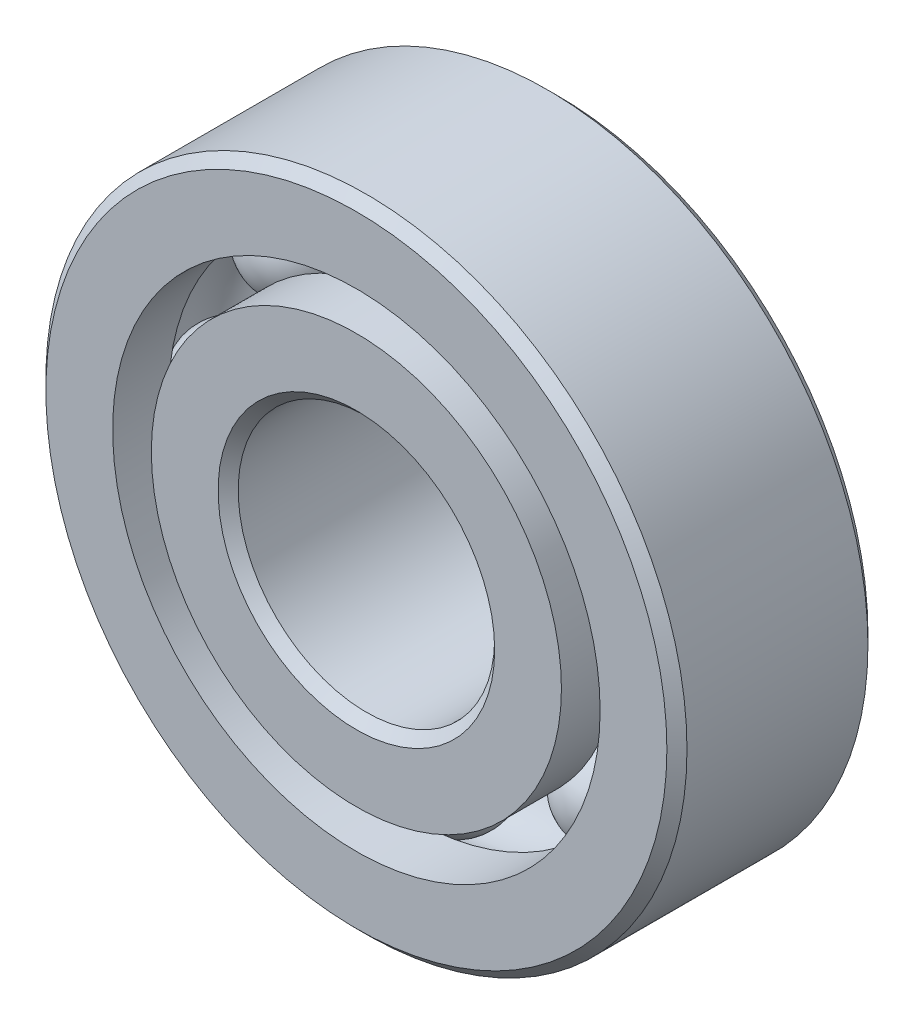
ISO-10303-21;
HEADER;
FILE_DESCRIPTION(('STEP AP214'),'2;1');
FILE_NAME('part.step','',(''),(''),'','','');
FILE_SCHEMA(('AUTOMOTIVE_DESIGN { 1 0 10303 214 1 1 1 1 }'));
ENDSEC;
DATA;
#1=APPLICATION_CONTEXT('core data for automotive mechanical design processes');
#2=APPLICATION_PROTOCOL_DEFINITION('international standard','automotive_design',2000,#1);
#3=PRODUCT_CONTEXT('',#1,'mechanical');
#4=PRODUCT('Part','Part','',(#3));
#5=PRODUCT_RELATED_PRODUCT_CATEGORY('part','',(#4));
#6=PRODUCT_DEFINITION_FORMATION('','',#4);
#7=PRODUCT_DEFINITION_CONTEXT('part definition',#1,'design');
#8=PRODUCT_DEFINITION('design','',#6,#7);
#9=PRODUCT_DEFINITION_SHAPE('','',#8);
#10=(LENGTH_UNIT() NAMED_UNIT(*) SI_UNIT(.MILLI.,.METRE.));
#11=(NAMED_UNIT(*) PLANE_ANGLE_UNIT() SI_UNIT($,.RADIAN.));
#12=(NAMED_UNIT(*) SI_UNIT($,.STERADIAN.) SOLID_ANGLE_UNIT());
#13=UNCERTAINTY_MEASURE_WITH_UNIT(LENGTH_MEASURE(1.E-05),#10,'distance_accuracy_value','');
#14=(GEOMETRIC_REPRESENTATION_CONTEXT(3) GLOBAL_UNCERTAINTY_ASSIGNED_CONTEXT((#13)) GLOBAL_UNIT_ASSIGNED_CONTEXT((#10,
#11,#12)) REPRESENTATION_CONTEXT('',''));
#15=CARTESIAN_POINT('',(0.,0.,0.));
#16=DIRECTION('',(0.,0.,1.));
#17=DIRECTION('',(1.,0.,0.));
#18=AXIS2_PLACEMENT_3D('',#15,#16,#17);
#19=CARTESIAN_POINT('',(-3.92886205296771,3.9288620529678,0.));
#20=DIRECTION('',(0.,0.,1.));
#21=DIRECTION('',(-0.707106781186539,0.707106781186556,0.));
#22=AXIS2_PLACEMENT_3D('',#19,#20,#21);
#23=SPHERICAL_SURFACE('',#22,1.20554465033679);
#24=CARTESIAN_POINT('',(-3.92886205296771,3.9288620529678,1.20554465033679));
#25=VERTEX_POINT('',#24);
#26=VERTEX_LOOP('',#25);
#27=FACE_BOUND('',#26,.T.);
#28=ADVANCED_FACE('F42',(#27),#23,.T.);
#29=CLOSED_SHELL('',(#28));
#30=MANIFOLD_SOLID_BREP('B2',#29);
#31=CARTESIAN_POINT('',(-5.55625,0.,0.));
#32=DIRECTION('',(0.,0.,1.));
#33=DIRECTION('',(-1.,0.,0.));
#34=AXIS2_PLACEMENT_3D('',#31,#32,#33);
#35=SPHERICAL_SURFACE('',#34,1.20554465033679);
#36=CARTESIAN_POINT('',(-5.55625,0.,1.20554465033679));
#37=VERTEX_POINT('',#36);
#38=VERTEX_LOOP('',#37);
#39=FACE_BOUND('',#38,.T.);
#40=ADVANCED_FACE('F63',(#39),#35,.T.);
#41=CLOSED_SHELL('',(#40));
#42=MANIFOLD_SOLID_BREP('B6',#41);
#43=CARTESIAN_POINT('',(-3.92886205296779,-3.92886205296772,0.));
#44=DIRECTION('',(0.,0.,1.));
#45=DIRECTION('',(-0.707106781186554,-0.707106781186541,0.));
#46=AXIS2_PLACEMENT_3D('',#43,#44,#45);
#47=SPHERICAL_SURFACE('',#46,1.20554465033679);
#48=CARTESIAN_POINT('',(-3.92886205296779,-3.92886205296772,1.20554465033679));
#49=VERTEX_POINT('',#48);
#50=VERTEX_LOOP('',#49);
#51=FACE_BOUND('',#50,.T.);
#52=ADVANCED_FACE('F84',(#51),#47,.T.);
#53=CLOSED_SHELL('',(#52));
#54=MANIFOLD_SOLID_BREP('B38',#53);
#55=CARTESIAN_POINT('',(0.,-5.55625,0.));
#56=DIRECTION('',(0.,0.,1.));
#57=DIRECTION('',(0.,-1.,0.));
#58=AXIS2_PLACEMENT_3D('',#55,#56,#57);
#59=SPHERICAL_SURFACE('',#58,1.20554465033679);
#60=CARTESIAN_POINT('',(0.,-5.55625,1.20554465033679));
#61=VERTEX_POINT('',#60);
#62=VERTEX_LOOP('',#61);
#63=FACE_BOUND('',#62,.T.);
#64=ADVANCED_FACE('F105',(#63),#59,.T.);
#65=CLOSED_SHELL('',(#64));
#66=MANIFOLD_SOLID_BREP('B59',#65);
#67=CARTESIAN_POINT('',(3.92886205296773,-3.92886205296777,0.));
#68=DIRECTION('',(0.,0.,1.));
#69=DIRECTION('',(0.707106781186544,-0.707106781186551,0.));
#70=AXIS2_PLACEMENT_3D('',#67,#68,#69);
#71=SPHERICAL_SURFACE('',#70,1.20554465033679);
#72=CARTESIAN_POINT('',(3.92886205296773,-3.92886205296777,1.20554465033679));
#73=VERTEX_POINT('',#72);
#74=VERTEX_LOOP('',#73);
#75=FACE_BOUND('',#74,.T.);
#76=ADVANCED_FACE('F126',(#75),#71,.T.);
#77=CLOSED_SHELL('',(#76));
#78=MANIFOLD_SOLID_BREP('B80',#77);
#79=CARTESIAN_POINT('',(5.55625,0.,0.));
#80=DIRECTION('',(0.,0.,1.));
#81=DIRECTION('',(1.,0.,0.));
#82=AXIS2_PLACEMENT_3D('',#79,#80,#81);
#83=SPHERICAL_SURFACE('',#82,1.20554465033679);
#84=CARTESIAN_POINT('',(5.55625,0.,1.20554465033679));
#85=VERTEX_POINT('',#84);
#86=VERTEX_LOOP('',#85);
#87=FACE_BOUND('',#86,.T.);
#88=ADVANCED_FACE('F147',(#87),#83,.T.);
#89=CLOSED_SHELL('',(#88));
#90=MANIFOLD_SOLID_BREP('B101',#89);
#91=CARTESIAN_POINT('',(3.92886205296776,3.92886205296775,0.));
#92=DIRECTION('',(0.,0.,1.));
#93=DIRECTION('',(0.707106781186549,0.707106781186546,0.));
#94=AXIS2_PLACEMENT_3D('',#91,#92,#93);
#95=SPHERICAL_SURFACE('',#94,1.20554465033679);
#96=CARTESIAN_POINT('',(3.92886205296776,3.92886205296775,1.20554465033679));
#97=VERTEX_POINT('',#96);
#98=VERTEX_LOOP('',#97);
#99=FACE_BOUND('',#98,.T.);
#100=ADVANCED_FACE('F168',(#99),#95,.T.);
#101=CLOSED_SHELL('',(#100));
#102=MANIFOLD_SOLID_BREP('B122',#101);
#103=CARTESIAN_POINT('',(0.,5.55625,0.));
#104=DIRECTION('',(0.,0.,1.));
#105=DIRECTION('',(0.,1.,0.));
#106=AXIS2_PLACEMENT_3D('',#103,#104,#105);
#107=SPHERICAL_SURFACE('',#106,1.20554465033679);
#108=CARTESIAN_POINT('',(0.,5.55625,1.20554465033679));
#109=VERTEX_POINT('',#108);
#110=VERTEX_LOOP('',#109);
#111=FACE_BOUND('',#110,.T.);
#112=ADVANCED_FACE('F191',(#111),#107,.T.);
#113=CLOSED_SHELL('',(#112));
#114=MANIFOLD_SOLID_BREP('B143',#113);
#115=CARTESIAN_POINT('',(0.,5.07727857142857,2.4892));
#116=DIRECTION('',(0.,0.,-1.));
#117=DIRECTION('',(-1.,0.,0.));
#118=AXIS2_PLACEMENT_3D('',#115,#116,#117);
#119=PLANE('',#118);
#120=CARTESIAN_POINT('',(0.,0.,2.4892));
#121=DIRECTION('',(0.,0.,1.));
#122=DIRECTION('',(1.,0.,0.));
#123=AXIS2_PLACEMENT_3D('',#120,#121,#122);
#124=CIRCLE('',#123,3.42392);
#125=CARTESIAN_POINT('',(3.42392,0.,2.4892));
#126=VERTEX_POINT('',#125);
#127=EDGE_CURVE('E239',#126,#126,#124,.T.);
#128=ORIENTED_EDGE('',*,*,#127,.F.);
#129=EDGE_LOOP('',(#128));
#130=FACE_BOUND('',#129,.T.);
#131=CARTESIAN_POINT('',(0.,0.,2.4892));
#132=DIRECTION('',(0.,0.,1.));
#133=DIRECTION('',(1.,0.,0.));
#134=AXIS2_PLACEMENT_3D('',#131,#132,#133);
#135=CIRCLE('',#134,5.07727857142857);
#136=CARTESIAN_POINT('',(5.07727857142857,0.,2.4892));
#137=VERTEX_POINT('',#136);
#138=EDGE_CURVE('E190',#137,#137,#135,.T.);
#139=ORIENTED_EDGE('',*,*,#138,.T.);
#140=EDGE_LOOP('',(#139));
#141=FACE_BOUND('',#140,.T.);
#142=ADVANCED_FACE('F211',(#130,#141),#119,.F.);
#143=CARTESIAN_POINT('',(0.,0.,2.4892));
#144=DIRECTION('',(0.,0.,1.));
#145=DIRECTION('',(1.,0.,0.));
#146=AXIS2_PLACEMENT_3D('',#143,#144,#145);
#147=CYLINDRICAL_SURFACE('',#146,5.07727857142857);
#148=ORIENTED_EDGE('',*,*,#138,.F.);
#149=EDGE_LOOP('',(#148));
#150=FACE_BOUND('',#149,.T.);
#151=CARTESIAN_POINT('',(0.,0.,1.10631111111111));
#152=DIRECTION('',(0.,0.,1.));
#153=DIRECTION('',(1.,0.,0.));
#154=AXIS2_PLACEMENT_3D('',#151,#152,#153);
#155=CIRCLE('',#154,5.07727857142857);
#156=CARTESIAN_POINT('',(5.07727857142857,0.,1.10631111111111));
#157=VERTEX_POINT('',#156);
#158=EDGE_CURVE('E217',#157,#157,#155,.T.);
#159=ORIENTED_EDGE('',*,*,#158,.T.);
#160=EDGE_LOOP('',(#159));
#161=FACE_BOUND('',#160,.T.);
#162=ADVANCED_FACE('F246',(#150,#161),#147,.T.);
#163=CARTESIAN_POINT('',(0.,0.,0.));
#164=DIRECTION('',(0.,0.,1.));
#165=DIRECTION('',(1.,0.,0.));
#166=AXIS2_PLACEMENT_3D('',#163,#164,#165);
#167=TOROIDAL_SURFACE('',#166,5.55625,1.20554465033679);
#168=ORIENTED_EDGE('',*,*,#158,.F.);
#169=EDGE_LOOP('',(#168));
#170=FACE_BOUND('',#169,.T.);
#171=CARTESIAN_POINT('',(0.,0.,-1.10631111111112));
#172=DIRECTION('',(0.,0.,1.));
#173=DIRECTION('',(1.,0.,0.));
#174=AXIS2_PLACEMENT_3D('',#171,#172,#173);
#175=CIRCLE('',#174,5.07727857142857);
#176=CARTESIAN_POINT('',(5.07727857142857,0.,-1.10631111111112));
#177=VERTEX_POINT('',#176);
#178=EDGE_CURVE('E221',#177,#177,#175,.T.);
#179=ORIENTED_EDGE('',*,*,#178,.T.);
#180=EDGE_LOOP('',(#179));
#181=FACE_BOUND('',#180,.T.);
#182=ADVANCED_FACE('F250',(#170,#181),#167,.F.);
#183=CARTESIAN_POINT('',(0.,0.,2.4892));
#184=DIRECTION('',(0.,0.,1.));
#185=DIRECTION('',(1.,0.,0.));
#186=AXIS2_PLACEMENT_3D('',#183,#184,#185);
#187=CYLINDRICAL_SURFACE('',#186,5.07727857142857);
#188=ORIENTED_EDGE('',*,*,#178,.F.);
#189=EDGE_LOOP('',(#188));
#190=FACE_BOUND('',#189,.T.);
#191=CARTESIAN_POINT('',(0.,0.,-2.4892));
#192=DIRECTION('',(0.,0.,1.));
#193=DIRECTION('',(1.,0.,0.));
#194=AXIS2_PLACEMENT_3D('',#191,#192,#193);
#195=CIRCLE('',#194,5.07727857142857);
#196=CARTESIAN_POINT('',(5.07727857142857,0.,-2.4892));
#197=VERTEX_POINT('',#196);
#198=EDGE_CURVE('E225',#197,#197,#195,.T.);
#199=ORIENTED_EDGE('',*,*,#198,.T.);
#200=EDGE_LOOP('',(#199));
#201=FACE_BOUND('',#200,.T.);
#202=ADVANCED_FACE('F255',(#190,#201),#187,.T.);
#203=CARTESIAN_POINT('',(0.,3.42392,-2.4892));
#204=DIRECTION('',(0.,0.,1.));
#205=DIRECTION('',(1.,0.,0.));
#206=AXIS2_PLACEMENT_3D('',#203,#204,#205);
#207=PLANE('',#206);
#208=ORIENTED_EDGE('',*,*,#198,.F.);
#209=EDGE_LOOP('',(#208));
#210=FACE_BOUND('',#209,.T.);
#211=CARTESIAN_POINT('',(0.,0.,-2.4892));
#212=DIRECTION('',(0.,0.,1.));
#213=DIRECTION('',(1.,0.,0.));
#214=AXIS2_PLACEMENT_3D('',#211,#212,#213);
#215=CIRCLE('',#214,3.42392);
#216=CARTESIAN_POINT('',(3.42392,0.,-2.4892));
#217=VERTEX_POINT('',#216);
#218=EDGE_CURVE('E230',#217,#217,#215,.T.);
#219=ORIENTED_EDGE('',*,*,#218,.T.);
#220=EDGE_LOOP('',(#219));
#221=FACE_BOUND('',#220,.T.);
#222=ADVANCED_FACE('F261',(#210,#221),#207,.F.);
#223=CARTESIAN_POINT('',(0.,0.,-2.24028));
#224=DIRECTION('',(0.,0.,-1.));
#225=DIRECTION('',(-1.,0.,0.));
#226=AXIS2_PLACEMENT_3D('',#223,#224,#225);
#227=CONICAL_SURFACE('',#226,3.175,0.785398163397453);
#228=ORIENTED_EDGE('',*,*,#218,.F.);
#229=EDGE_LOOP('',(#228));
#230=FACE_BOUND('',#229,.T.);
#231=CARTESIAN_POINT('',(0.,0.,-2.24028));
#232=DIRECTION('',(0.,0.,1.));
#233=DIRECTION('',(1.,0.,0.));
#234=AXIS2_PLACEMENT_3D('',#231,#232,#233);
#235=CIRCLE('',#234,3.175);
#236=CARTESIAN_POINT('',(3.175,0.,-2.24028));
#237=VERTEX_POINT('',#236);
#238=EDGE_CURVE('E233',#237,#237,#235,.T.);
#239=ORIENTED_EDGE('',*,*,#238,.T.);
#240=EDGE_LOOP('',(#239));
#241=FACE_BOUND('',#240,.T.);
#242=ADVANCED_FACE('F265',(#230,#241),#227,.F.);
#243=CARTESIAN_POINT('',(0.,0.,2.4892));
#244=DIRECTION('',(0.,0.,1.));
#245=DIRECTION('',(1.,0.,0.));
#246=AXIS2_PLACEMENT_3D('',#243,#244,#245);
#247=CYLINDRICAL_SURFACE('',#246,3.175);
#248=ORIENTED_EDGE('',*,*,#238,.F.);
#249=EDGE_LOOP('',(#248));
#250=FACE_BOUND('',#249,.T.);
#251=CARTESIAN_POINT('',(0.,0.,2.24028));
#252=DIRECTION('',(0.,0.,1.));
#253=DIRECTION('',(1.,0.,0.));
#254=AXIS2_PLACEMENT_3D('',#251,#252,#253);
#255=CIRCLE('',#254,3.175);
#256=CARTESIAN_POINT('',(3.175,0.,2.24028));
#257=VERTEX_POINT('',#256);
#258=EDGE_CURVE('E236',#257,#257,#255,.T.);
#259=ORIENTED_EDGE('',*,*,#258,.T.);
#260=EDGE_LOOP('',(#259));
#261=FACE_BOUND('',#260,.T.);
#262=ADVANCED_FACE('F269',(#250,#261),#247,.F.);
#263=CARTESIAN_POINT('',(0.,0.,2.4892));
#264=DIRECTION('',(0.,0.,1.));
#265=DIRECTION('',(1.,0.,0.));
#266=AXIS2_PLACEMENT_3D('',#263,#264,#265);
#267=CONICAL_SURFACE('',#266,3.42392,0.785398163397449);
#268=ORIENTED_EDGE('',*,*,#258,.F.);
#269=EDGE_LOOP('',(#268));
#270=FACE_BOUND('',#269,.T.);
#271=ORIENTED_EDGE('',*,*,#127,.T.);
#272=EDGE_LOOP('',(#271));
#273=FACE_BOUND('',#272,.T.);
#274=ADVANCED_FACE('F243',(#270,#273),#267,.F.);
#275=CLOSED_SHELL('',(#142,#162,#182,#202,#222,#242,#262,#274));
#276=MANIFOLD_SOLID_BREP('B164',#275);
#277=CARTESIAN_POINT('',(0.,0.,2.24028));
#278=DIRECTION('',(0.,0.,-1.));
#279=DIRECTION('',(-1.,0.,0.));
#280=AXIS2_PLACEMENT_3D('',#277,#278,#279);
#281=CONICAL_SURFACE('',#280,7.9375,0.785398163397446);
#282=CARTESIAN_POINT('',(0.,0.,2.4892));
#283=DIRECTION('',(0.,0.,1.));
#284=DIRECTION('',(1.,0.,0.));
#285=AXIS2_PLACEMENT_3D('',#282,#283,#284);
#286=CIRCLE('',#285,7.68858);
#287=CARTESIAN_POINT('',(7.68858,0.,2.4892));
#288=VERTEX_POINT('',#287);
#289=EDGE_CURVE('E361',#288,#288,#286,.T.);
#290=ORIENTED_EDGE('',*,*,#289,.F.);
#291=EDGE_LOOP('',(#290));
#292=FACE_BOUND('',#291,.T.);
#293=CARTESIAN_POINT('',(0.,0.,2.24028));
#294=DIRECTION('',(0.,0.,1.));
#295=DIRECTION('',(1.,0.,0.));
#296=AXIS2_PLACEMENT_3D('',#293,#294,#295);
#297=CIRCLE('',#296,7.9375);
#298=CARTESIAN_POINT('',(7.9375,0.,2.24028));
#299=VERTEX_POINT('',#298);
#300=EDGE_CURVE('E210',#299,#299,#297,.T.);
#301=ORIENTED_EDGE('',*,*,#300,.T.);
#302=EDGE_LOOP('',(#301));
#303=FACE_BOUND('',#302,.T.);
#304=ADVANCED_FACE('F333',(#292,#303),#281,.T.);
#305=CARTESIAN_POINT('',(0.,0.,2.4892));
#306=DIRECTION('',(0.,0.,1.));
#307=DIRECTION('',(1.,0.,0.));
#308=AXIS2_PLACEMENT_3D('',#305,#306,#307);
#309=CYLINDRICAL_SURFACE('',#308,7.9375);
#310=ORIENTED_EDGE('',*,*,#300,.F.);
#311=EDGE_LOOP('',(#310));
#312=FACE_BOUND('',#311,.T.);
#313=CARTESIAN_POINT('',(0.,0.,-2.24028));
#314=DIRECTION('',(0.,0.,1.));
#315=DIRECTION('',(1.,0.,0.));
#316=AXIS2_PLACEMENT_3D('',#313,#314,#315);
#317=CIRCLE('',#316,7.9375);
#318=CARTESIAN_POINT('',(7.9375,0.,-2.24028));
#319=VERTEX_POINT('',#318);
#320=EDGE_CURVE('E339',#319,#319,#317,.T.);
#321=ORIENTED_EDGE('',*,*,#320,.T.);
#322=EDGE_LOOP('',(#321));
#323=FACE_BOUND('',#322,.T.);
#324=ADVANCED_FACE('F368',(#312,#323),#309,.T.);
#325=CARTESIAN_POINT('',(0.,0.,-2.4892));
#326=DIRECTION('',(0.,0.,1.));
#327=DIRECTION('',(1.,0.,0.));
#328=AXIS2_PLACEMENT_3D('',#325,#326,#327);
#329=CONICAL_SURFACE('',#328,7.68858,0.785398163397445);
#330=ORIENTED_EDGE('',*,*,#320,.F.);
#331=EDGE_LOOP('',(#330));
#332=FACE_BOUND('',#331,.T.);
#333=CARTESIAN_POINT('',(0.,0.,-2.4892));
#334=DIRECTION('',(0.,0.,1.));
#335=DIRECTION('',(1.,0.,0.));
#336=AXIS2_PLACEMENT_3D('',#333,#334,#335);
#337=CIRCLE('',#336,7.68858);
#338=CARTESIAN_POINT('',(7.68858,0.,-2.4892));
#339=VERTEX_POINT('',#338);
#340=EDGE_CURVE('E343',#339,#339,#337,.T.);
#341=ORIENTED_EDGE('',*,*,#340,.T.);
#342=EDGE_LOOP('',(#341));
#343=FACE_BOUND('',#342,.T.);
#344=ADVANCED_FACE('F372',(#332,#343),#329,.T.);
#345=CARTESIAN_POINT('',(0.,7.68858,-2.4892));
#346=DIRECTION('',(0.,0.,1.));
#347=DIRECTION('',(1.,0.,0.));
#348=AXIS2_PLACEMENT_3D('',#345,#346,#347);
#349=PLANE('',#348);
#350=ORIENTED_EDGE('',*,*,#340,.F.);
#351=EDGE_LOOP('',(#350));
#352=FACE_BOUND('',#351,.T.);
#353=CARTESIAN_POINT('',(0.,0.,-2.4892));
#354=DIRECTION('',(0.,0.,1.));
#355=DIRECTION('',(1.,0.,0.));
#356=AXIS2_PLACEMENT_3D('',#353,#354,#355);
#357=CIRCLE('',#356,6.03522142857143);
#358=CARTESIAN_POINT('',(6.03522142857143,0.,-2.4892));
#359=VERTEX_POINT('',#358);
#360=EDGE_CURVE('E347',#359,#359,#357,.T.);
#361=ORIENTED_EDGE('',*,*,#360,.T.);
#362=EDGE_LOOP('',(#361));
#363=FACE_BOUND('',#362,.T.);
#364=ADVANCED_FACE('F377',(#352,#363),#349,.F.);
#365=CARTESIAN_POINT('',(0.,0.,2.4892));
#366=DIRECTION('',(0.,0.,1.));
#367=DIRECTION('',(1.,0.,0.));
#368=AXIS2_PLACEMENT_3D('',#365,#366,#367);
#369=CYLINDRICAL_SURFACE('',#368,6.03522142857143);
#370=ORIENTED_EDGE('',*,*,#360,.F.);
#371=EDGE_LOOP('',(#370));
#372=FACE_BOUND('',#371,.T.);
#373=CARTESIAN_POINT('',(0.,0.,-1.10631111111111));
#374=DIRECTION('',(0.,0.,1.));
#375=DIRECTION('',(1.,0.,0.));
#376=AXIS2_PLACEMENT_3D('',#373,#374,#375);
#377=CIRCLE('',#376,6.03522142857143);
#378=CARTESIAN_POINT('',(6.03522142857143,0.,-1.10631111111111));
#379=VERTEX_POINT('',#378);
#380=EDGE_CURVE('E352',#379,#379,#377,.T.);
#381=ORIENTED_EDGE('',*,*,#380,.T.);
#382=EDGE_LOOP('',(#381));
#383=FACE_BOUND('',#382,.T.);
#384=ADVANCED_FACE('F383',(#372,#383),#369,.F.);
#385=CARTESIAN_POINT('',(0.,0.,0.));
#386=DIRECTION('',(0.,0.,1.));
#387=DIRECTION('',(1.,0.,0.));
#388=AXIS2_PLACEMENT_3D('',#385,#386,#387);
#389=TOROIDAL_SURFACE('',#388,5.55625,1.20554465033679);
#390=ORIENTED_EDGE('',*,*,#380,.F.);
#391=EDGE_LOOP('',(#390));
#392=FACE_BOUND('',#391,.T.);
#393=CARTESIAN_POINT('',(0.,0.,1.10631111111111));
#394=DIRECTION('',(0.,0.,1.));
#395=DIRECTION('',(1.,0.,0.));
#396=AXIS2_PLACEMENT_3D('',#393,#394,#395);
#397=CIRCLE('',#396,6.03522142857143);
#398=CARTESIAN_POINT('',(6.03522142857143,0.,1.10631111111111));
#399=VERTEX_POINT('',#398);
#400=EDGE_CURVE('E355',#399,#399,#397,.T.);
#401=ORIENTED_EDGE('',*,*,#400,.T.);
#402=EDGE_LOOP('',(#401));
#403=FACE_BOUND('',#402,.T.);
#404=ADVANCED_FACE('F387',(#392,#403),#389,.F.);
#405=CARTESIAN_POINT('',(0.,0.,2.4892));
#406=DIRECTION('',(0.,0.,1.));
#407=DIRECTION('',(1.,0.,0.));
#408=AXIS2_PLACEMENT_3D('',#405,#406,#407);
#409=CYLINDRICAL_SURFACE('',#408,6.03522142857143);
#410=ORIENTED_EDGE('',*,*,#400,.F.);
#411=EDGE_LOOP('',(#410));
#412=FACE_BOUND('',#411,.T.);
#413=CARTESIAN_POINT('',(0.,0.,2.4892));
#414=DIRECTION('',(0.,0.,1.));
#415=DIRECTION('',(1.,0.,0.));
#416=AXIS2_PLACEMENT_3D('',#413,#414,#415);
#417=CIRCLE('',#416,6.03522142857143);
#418=CARTESIAN_POINT('',(6.03522142857143,0.,2.4892));
#419=VERTEX_POINT('',#418);
#420=EDGE_CURVE('E358',#419,#419,#417,.T.);
#421=ORIENTED_EDGE('',*,*,#420,.T.);
#422=EDGE_LOOP('',(#421));
#423=FACE_BOUND('',#422,.T.);
#424=ADVANCED_FACE('F391',(#412,#423),#409,.F.);
#425=CARTESIAN_POINT('',(0.,7.68858,2.4892));
#426=DIRECTION('',(0.,0.,-1.));
#427=DIRECTION('',(-1.,0.,0.));
#428=AXIS2_PLACEMENT_3D('',#425,#426,#427);
#429=PLANE('',#428);
#430=ORIENTED_EDGE('',*,*,#420,.F.);
#431=EDGE_LOOP('',(#430));
#432=FACE_BOUND('',#431,.T.);
#433=ORIENTED_EDGE('',*,*,#289,.T.);
#434=EDGE_LOOP('',(#433));
#435=FACE_BOUND('',#434,.T.);
#436=ADVANCED_FACE('F365',(#432,#435),#429,.F.);
#437=CLOSED_SHELL('',(#304,#324,#344,#364,#384,#404,#424,#436));
#438=MANIFOLD_SOLID_BREP('B185',#437);
#439=ADVANCED_BREP_SHAPE_REPRESENTATION('',(#18,#30,#42,#54,#66,#78,#90,#102,#114,#276,#438),#14);
#440=SHAPE_DEFINITION_REPRESENTATION(#9,#439);
ENDSEC;
END-ISO-10303-21;
